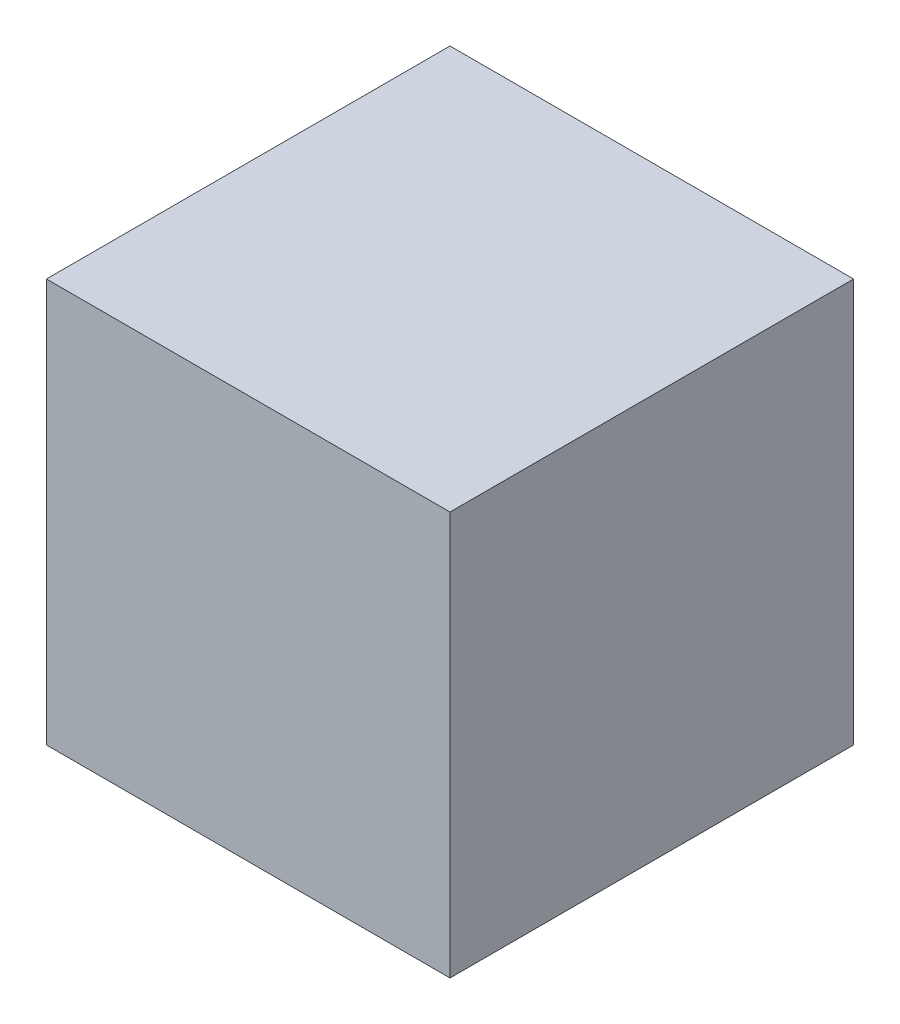
ISO-10303-21;
HEADER;
FILE_DESCRIPTION(('STEP AP214'),'2;1');
FILE_NAME('part.step','',(''),(''),'','','');
FILE_SCHEMA(('AUTOMOTIVE_DESIGN { 1 0 10303 214 1 1 1 1 }'));
ENDSEC;
DATA;
#1=APPLICATION_CONTEXT('core data for automotive mechanical design processes');
#2=APPLICATION_PROTOCOL_DEFINITION('international standard','automotive_design',2000,#1);
#3=PRODUCT_CONTEXT('',#1,'mechanical');
#4=PRODUCT('Part','Part','',(#3));
#5=PRODUCT_RELATED_PRODUCT_CATEGORY('part','',(#4));
#6=PRODUCT_DEFINITION_FORMATION('','',#4);
#7=PRODUCT_DEFINITION_CONTEXT('part definition',#1,'design');
#8=PRODUCT_DEFINITION('design','',#6,#7);
#9=PRODUCT_DEFINITION_SHAPE('','',#8);
#10=(LENGTH_UNIT() NAMED_UNIT(*) SI_UNIT(.MILLI.,.METRE.));
#11=(NAMED_UNIT(*) PLANE_ANGLE_UNIT() SI_UNIT($,.RADIAN.));
#12=(NAMED_UNIT(*) SI_UNIT($,.STERADIAN.) SOLID_ANGLE_UNIT());
#13=UNCERTAINTY_MEASURE_WITH_UNIT(LENGTH_MEASURE(1.E-05),#10,'distance_accuracy_value','');
#14=(GEOMETRIC_REPRESENTATION_CONTEXT(3) GLOBAL_UNCERTAINTY_ASSIGNED_CONTEXT((#13)) GLOBAL_UNIT_ASSIGNED_CONTEXT((#10,
#11,#12)) REPRESENTATION_CONTEXT('',''));
#15=CARTESIAN_POINT('',(0.,0.,0.));
#16=DIRECTION('',(0.,0.,1.));
#17=DIRECTION('',(1.,0.,0.));
#18=AXIS2_PLACEMENT_3D('',#15,#16,#17);
#19=CARTESIAN_POINT('',(0.,152.4,0.));
#20=DIRECTION('',(0.,1.,0.));
#21=DIRECTION('',(0.,0.,1.));
#22=AXIS2_PLACEMENT_3D('',#19,#20,#21);
#23=PLANE('',#22);
#24=DIRECTION('',(1.,0.,0.));
#25=VECTOR('',#24,1.);
#26=CARTESIAN_POINT('',(-76.2,152.4,76.2));
#27=LINE('',#26,#25);
#28=CARTESIAN_POINT('',(76.2,152.4,76.2));
#29=VERTEX_POINT('',#28);
#30=CARTESIAN_POINT('',(-76.2,152.4,76.2));
#31=VERTEX_POINT('',#30);
#32=EDGE_CURVE('E81',#29,#31,#27,.F.);
#33=ORIENTED_EDGE('',*,*,#32,.F.);
#34=DIRECTION('',(0.,0.,-1.));
#35=VECTOR('',#34,1.);
#36=CARTESIAN_POINT('',(76.2,152.4,76.2));
#37=LINE('',#36,#35);
#38=CARTESIAN_POINT('',(76.2,152.4,-76.2));
#39=VERTEX_POINT('',#38);
#40=EDGE_CURVE('E58',#39,#29,#37,.F.);
#41=ORIENTED_EDGE('',*,*,#40,.F.);
#42=DIRECTION('',(-1.,0.,0.));
#43=VECTOR('',#42,1.);
#44=CARTESIAN_POINT('',(76.2,152.4,-76.2));
#45=LINE('',#44,#43);
#46=CARTESIAN_POINT('',(-76.2,152.4,-76.2));
#47=VERTEX_POINT('',#46);
#48=EDGE_CURVE('E19',#47,#39,#45,.F.);
#49=ORIENTED_EDGE('',*,*,#48,.F.);
#50=DIRECTION('',(0.,0.,1.));
#51=VECTOR('',#50,1.);
#52=CARTESIAN_POINT('',(-76.2,152.4,-76.2));
#53=LINE('',#52,#51);
#54=EDGE_CURVE('E55',#31,#47,#53,.F.);
#55=ORIENTED_EDGE('',*,*,#54,.F.);
#56=EDGE_LOOP('',(#33,#41,#49,#55));
#57=FACE_BOUND('',#56,.T.);
#58=ADVANCED_FACE('F16',(#57),#23,.T.);
#59=CARTESIAN_POINT('',(76.2,0.,-76.2));
#60=DIRECTION('',(0.,0.,-1.));
#61=DIRECTION('',(-1.,0.,0.));
#62=AXIS2_PLACEMENT_3D('',#59,#60,#61);
#63=PLANE('',#62);
#64=DIRECTION('',(0.,1.,0.));
#65=VECTOR('',#64,1.);
#66=CARTESIAN_POINT('',(-76.2,0.,-76.2));
#67=LINE('',#66,#65);
#68=CARTESIAN_POINT('',(-76.2,0.,-76.2));
#69=VERTEX_POINT('',#68);
#70=EDGE_CURVE('E64',#47,#69,#67,.F.);
#71=ORIENTED_EDGE('',*,*,#70,.F.);
#72=ORIENTED_EDGE('',*,*,#48,.T.);
#73=DIRECTION('',(0.,1.,0.));
#74=VECTOR('',#73,1.);
#75=CARTESIAN_POINT('',(76.2,0.,-76.2));
#76=LINE('',#75,#74);
#77=CARTESIAN_POINT('',(76.2,0.,-76.2));
#78=VERTEX_POINT('',#77);
#79=EDGE_CURVE('E86',#78,#39,#76,.T.);
#80=ORIENTED_EDGE('',*,*,#79,.F.);
#81=DIRECTION('',(1.,0.,0.));
#82=VECTOR('',#81,1.);
#83=CARTESIAN_POINT('',(0.,0.,-76.2));
#84=LINE('',#83,#82);
#85=EDGE_CURVE('E75',#78,#69,#84,.F.);
#86=ORIENTED_EDGE('',*,*,#85,.T.);
#87=EDGE_LOOP('',(#71,#72,#80,#86));
#88=FACE_BOUND('',#87,.T.);
#89=ADVANCED_FACE('F74',(#88),#63,.T.);
#90=CARTESIAN_POINT('',(-76.2,0.,-76.2));
#91=DIRECTION('',(-1.,0.,0.));
#92=DIRECTION('',(0.,0.,1.));
#93=AXIS2_PLACEMENT_3D('',#90,#91,#92);
#94=PLANE('',#93);
#95=DIRECTION('',(0.,1.,0.));
#96=VECTOR('',#95,1.);
#97=CARTESIAN_POINT('',(-76.2,0.,76.2));
#98=LINE('',#97,#96);
#99=CARTESIAN_POINT('',(-76.2,0.,76.2));
#100=VERTEX_POINT('',#99);
#101=EDGE_CURVE('E70',#31,#100,#98,.F.);
#102=ORIENTED_EDGE('',*,*,#101,.F.);
#103=ORIENTED_EDGE('',*,*,#54,.T.);
#104=ORIENTED_EDGE('',*,*,#70,.T.);
#105=DIRECTION('',(0.,0.,1.));
#106=VECTOR('',#105,1.);
#107=CARTESIAN_POINT('',(-76.2,0.,0.));
#108=LINE('',#107,#106);
#109=EDGE_CURVE('E93',#69,#100,#108,.T.);
#110=ORIENTED_EDGE('',*,*,#109,.T.);
#111=EDGE_LOOP('',(#102,#103,#104,#110));
#112=FACE_BOUND('',#111,.T.);
#113=ADVANCED_FACE('F67',(#112),#94,.T.);
#114=CARTESIAN_POINT('',(-76.2,0.,76.2));
#115=DIRECTION('',(0.,0.,1.));
#116=DIRECTION('',(1.,0.,0.));
#117=AXIS2_PLACEMENT_3D('',#114,#115,#116);
#118=PLANE('',#117);
#119=DIRECTION('',(0.,1.,0.));
#120=VECTOR('',#119,1.);
#121=CARTESIAN_POINT('',(76.2,0.,76.2));
#122=LINE('',#121,#120);
#123=CARTESIAN_POINT('',(76.2,0.,76.2));
#124=VERTEX_POINT('',#123);
#125=EDGE_CURVE('E34',#29,#124,#122,.F.);
#126=ORIENTED_EDGE('',*,*,#125,.F.);
#127=ORIENTED_EDGE('',*,*,#32,.T.);
#128=ORIENTED_EDGE('',*,*,#101,.T.);
#129=DIRECTION('',(1.,0.,0.));
#130=VECTOR('',#129,1.);
#131=CARTESIAN_POINT('',(0.,0.,76.2));
#132=LINE('',#131,#130);
#133=EDGE_CURVE('E26',#100,#124,#132,.T.);
#134=ORIENTED_EDGE('',*,*,#133,.T.);
#135=EDGE_LOOP('',(#126,#127,#128,#134));
#136=FACE_BOUND('',#135,.T.);
#137=ADVANCED_FACE('F100',(#136),#118,.T.);
#138=CARTESIAN_POINT('',(76.2,0.,76.2));
#139=DIRECTION('',(1.,0.,0.));
#140=DIRECTION('',(0.,0.,-1.));
#141=AXIS2_PLACEMENT_3D('',#138,#139,#140);
#142=PLANE('',#141);
#143=ORIENTED_EDGE('',*,*,#79,.T.);
#144=ORIENTED_EDGE('',*,*,#40,.T.);
#145=ORIENTED_EDGE('',*,*,#125,.T.);
#146=DIRECTION('',(0.,0.,1.));
#147=VECTOR('',#146,1.);
#148=CARTESIAN_POINT('',(76.2,0.,0.));
#149=LINE('',#148,#147);
#150=EDGE_CURVE('E11',#124,#78,#149,.F.);
#151=ORIENTED_EDGE('',*,*,#150,.T.);
#152=EDGE_LOOP('',(#143,#144,#145,#151));
#153=FACE_BOUND('',#152,.T.);
#154=ADVANCED_FACE('F103',(#153),#142,.T.);
#155=CARTESIAN_POINT('',(0.,0.,0.));
#156=DIRECTION('',(0.,1.,0.));
#157=DIRECTION('',(0.,0.,1.));
#158=AXIS2_PLACEMENT_3D('',#155,#156,#157);
#159=PLANE('',#158);
#160=ORIENTED_EDGE('',*,*,#133,.F.);
#161=ORIENTED_EDGE('',*,*,#109,.F.);
#162=ORIENTED_EDGE('',*,*,#85,.F.);
#163=ORIENTED_EDGE('',*,*,#150,.F.);
#164=EDGE_LOOP('',(#160,#161,#162,#163));
#165=FACE_BOUND('',#164,.T.);
#166=ADVANCED_FACE('F102',(#165),#159,.F.);
#167=CLOSED_SHELL('',(#58,#89,#113,#137,#154,#166));
#168=MANIFOLD_SOLID_BREP('B1',#167);
#169=ADVANCED_BREP_SHAPE_REPRESENTATION('',(#18,#168),#14);
#170=SHAPE_DEFINITION_REPRESENTATION(#9,#169);
ENDSEC;
END-ISO-10303-21;
